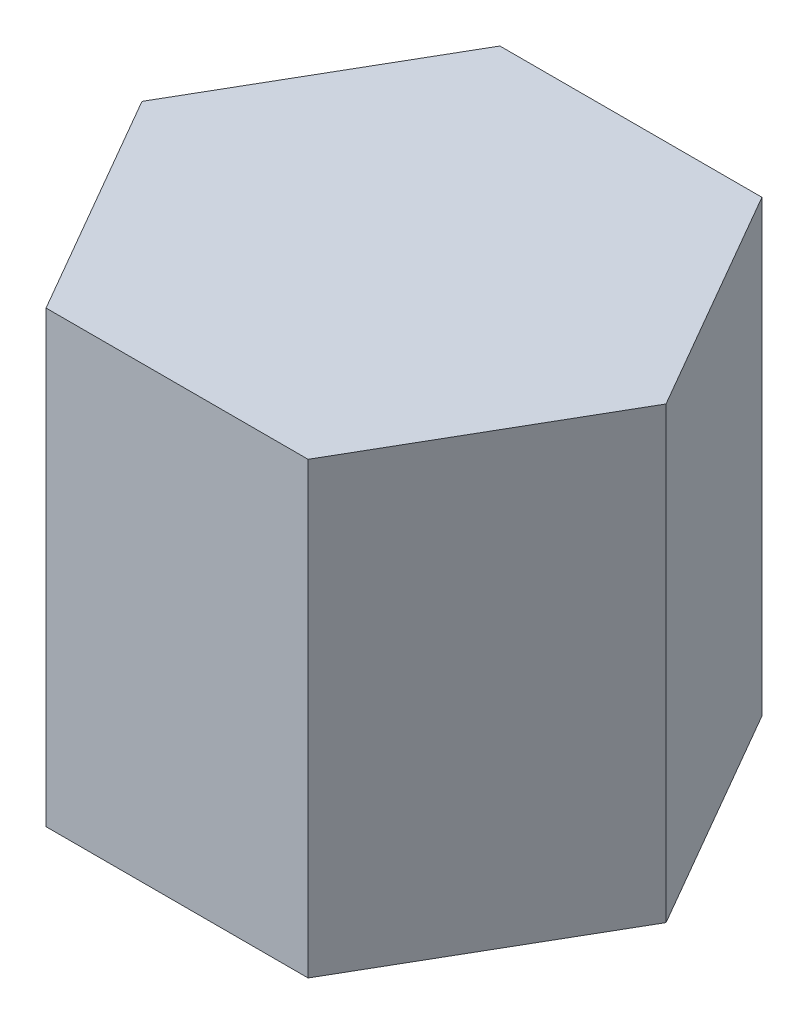
ISO-10303-21;
HEADER;
FILE_DESCRIPTION(('STEP AP214'),'2;1');
FILE_NAME('part.step','',(''),(''),'','','');
FILE_SCHEMA(('AUTOMOTIVE_DESIGN { 1 0 10303 214 1 1 1 1 }'));
ENDSEC;
DATA;
#1=APPLICATION_CONTEXT('core data for automotive mechanical design processes');
#2=APPLICATION_PROTOCOL_DEFINITION('international standard','automotive_design',2000,#1);
#3=PRODUCT_CONTEXT('',#1,'mechanical');
#4=PRODUCT('Part','Part','',(#3));
#5=PRODUCT_RELATED_PRODUCT_CATEGORY('part','',(#4));
#6=PRODUCT_DEFINITION_FORMATION('','',#4);
#7=PRODUCT_DEFINITION_CONTEXT('part definition',#1,'design');
#8=PRODUCT_DEFINITION('design','',#6,#7);
#9=PRODUCT_DEFINITION_SHAPE('','',#8);
#10=(LENGTH_UNIT() NAMED_UNIT(*) SI_UNIT(.MILLI.,.METRE.));
#11=(NAMED_UNIT(*) PLANE_ANGLE_UNIT() SI_UNIT($,.RADIAN.));
#12=(NAMED_UNIT(*) SI_UNIT($,.STERADIAN.) SOLID_ANGLE_UNIT());
#13=UNCERTAINTY_MEASURE_WITH_UNIT(LENGTH_MEASURE(1.E-05),#10,'distance_accuracy_value','');
#14=(GEOMETRIC_REPRESENTATION_CONTEXT(3) GLOBAL_UNCERTAINTY_ASSIGNED_CONTEXT((#13)) GLOBAL_UNIT_ASSIGNED_CONTEXT((#10,
#11,#12)) REPRESENTATION_CONTEXT('',''));
#15=CARTESIAN_POINT('',(0.,0.,0.));
#16=DIRECTION('',(0.,0.,1.));
#17=DIRECTION('',(1.,0.,0.));
#18=AXIS2_PLACEMENT_3D('',#15,#16,#17);
#19=CARTESIAN_POINT('',(44.4500000000008,152.4,76.9896583964359));
#20=DIRECTION('',(-0.866025403784442,0.,-0.499999999999995));
#21=DIRECTION('',(-0.499999999999995,0.,0.866025403784442));
#22=AXIS2_PLACEMENT_3D('',#19,#20,#21);
#23=PLANE('',#22);
#24=DIRECTION('',(0.499999999999995,0.,-0.866025403784441));
#25=VECTOR('',#24,1.);
#26=CARTESIAN_POINT('',(44.4500000000008,0.,76.9896583964359));
#27=LINE('',#26,#25);
#28=CARTESIAN_POINT('',(44.4500000000008,0.,76.9896583964359));
#29=VERTEX_POINT('',#28);
#30=CARTESIAN_POINT('',(88.8999999999998,0.,0.));
#31=VERTEX_POINT('',#30);
#32=EDGE_CURVE('E117',#29,#31,#27,.T.);
#33=ORIENTED_EDGE('',*,*,#32,.T.);
#34=DIRECTION('',(0.,-1.,0.));
#35=VECTOR('',#34,1.);
#36=CARTESIAN_POINT('',(88.8999999999998,152.4,0.));
#37=LINE('',#36,#35);
#38=CARTESIAN_POINT('',(88.8999999999998,152.4,0.));
#39=VERTEX_POINT('',#38);
#40=EDGE_CURVE('E11',#39,#31,#37,.T.);
#41=ORIENTED_EDGE('',*,*,#40,.F.);
#42=DIRECTION('',(0.499999999999995,0.,-0.866025403784441));
#43=VECTOR('',#42,1.);
#44=CARTESIAN_POINT('',(44.4500000000008,152.4,76.9896583964359));
#45=LINE('',#44,#43);
#46=CARTESIAN_POINT('',(44.4500000000008,152.4,76.9896583964359));
#47=VERTEX_POINT('',#46);
#48=EDGE_CURVE('E127',#47,#39,#45,.T.);
#49=ORIENTED_EDGE('',*,*,#48,.F.);
#50=DIRECTION('',(0.,-1.,0.));
#51=VECTOR('',#50,1.);
#52=CARTESIAN_POINT('',(44.4500000000008,152.4,76.9896583964359));
#53=LINE('',#52,#51);
#54=EDGE_CURVE('E113',#47,#29,#53,.T.);
#55=ORIENTED_EDGE('',*,*,#54,.T.);
#56=EDGE_LOOP('',(#33,#41,#49,#55));
#57=FACE_BOUND('',#56,.T.);
#58=ADVANCED_FACE('F33',(#57),#23,.F.);
#59=CARTESIAN_POINT('',(88.8999999999998,152.4,0.));
#60=DIRECTION('',(-0.866025403784438,0.,0.500000000000001));
#61=DIRECTION('',(0.500000000000001,0.,0.866025403784438));
#62=AXIS2_PLACEMENT_3D('',#59,#60,#61);
#63=PLANE('',#62);
#64=DIRECTION('',(-0.500000000000001,0.,-0.866025403784438));
#65=VECTOR('',#64,1.);
#66=CARTESIAN_POINT('',(88.8999999999998,0.,0.));
#67=LINE('',#66,#65);
#68=CARTESIAN_POINT('',(44.4499999999997,0.,-76.9896583964365));
#69=VERTEX_POINT('',#68);
#70=EDGE_CURVE('E120',#31,#69,#67,.T.);
#71=ORIENTED_EDGE('',*,*,#70,.T.);
#72=DIRECTION('',(0.,-1.,0.));
#73=VECTOR('',#72,1.);
#74=CARTESIAN_POINT('',(44.4499999999997,152.4,-76.9896583964365));
#75=LINE('',#74,#73);
#76=CARTESIAN_POINT('',(44.4499999999997,152.4,-76.9896583964365));
#77=VERTEX_POINT('',#76);
#78=EDGE_CURVE('E41',#77,#69,#75,.T.);
#79=ORIENTED_EDGE('',*,*,#78,.F.);
#80=DIRECTION('',(-0.500000000000001,0.,-0.866025403784438));
#81=VECTOR('',#80,1.);
#82=CARTESIAN_POINT('',(88.8999999999998,152.4,0.));
#83=LINE('',#82,#81);
#84=EDGE_CURVE('E86',#39,#77,#83,.T.);
#85=ORIENTED_EDGE('',*,*,#84,.F.);
#86=ORIENTED_EDGE('',*,*,#40,.T.);
#87=EDGE_LOOP('',(#71,#79,#85,#86));
#88=FACE_BOUND('',#87,.T.);
#89=ADVANCED_FACE('F151',(#88),#63,.F.);
#90=CARTESIAN_POINT('',(44.4499999999997,152.4,-76.9896583964365));
#91=DIRECTION('',(0.,0.,1.));
#92=DIRECTION('',(1.,0.,0.));
#93=AXIS2_PLACEMENT_3D('',#90,#91,#92);
#94=PLANE('',#93);
#95=DIRECTION('',(-1.,0.,0.));
#96=VECTOR('',#95,1.);
#97=CARTESIAN_POINT('',(44.4499999999997,0.,-76.9896583964365));
#98=LINE('',#97,#96);
#99=CARTESIAN_POINT('',(-44.4500000000003,0.,-76.9896583964362));
#100=VERTEX_POINT('',#99);
#101=EDGE_CURVE('E122',#69,#100,#98,.T.);
#102=ORIENTED_EDGE('',*,*,#101,.T.);
#103=DIRECTION('',(0.,-1.,0.));
#104=VECTOR('',#103,1.);
#105=CARTESIAN_POINT('',(-44.4500000000003,152.4,-76.9896583964362));
#106=LINE('',#105,#104);
#107=CARTESIAN_POINT('',(-44.4500000000003,152.4,-76.9896583964362));
#108=VERTEX_POINT('',#107);
#109=EDGE_CURVE('E108',#108,#100,#106,.T.);
#110=ORIENTED_EDGE('',*,*,#109,.F.);
#111=DIRECTION('',(-1.,0.,0.));
#112=VECTOR('',#111,1.);
#113=CARTESIAN_POINT('',(44.4499999999997,152.4,-76.9896583964365));
#114=LINE('',#113,#112);
#115=EDGE_CURVE('E99',#77,#108,#114,.T.);
#116=ORIENTED_EDGE('',*,*,#115,.F.);
#117=ORIENTED_EDGE('',*,*,#78,.T.);
#118=EDGE_LOOP('',(#102,#110,#116,#117));
#119=FACE_BOUND('',#118,.T.);
#120=ADVANCED_FACE('F133',(#119),#94,.F.);
#121=CARTESIAN_POINT('',(-44.4500000000003,152.4,-76.9896583964362));
#122=DIRECTION('',(0.866025403784442,0.,0.499999999999995));
#123=DIRECTION('',(0.499999999999995,0.,-0.866025403784442));
#124=AXIS2_PLACEMENT_3D('',#121,#122,#123);
#125=PLANE('',#124);
#126=DIRECTION('',(-0.499999999999995,0.,0.866025403784441));
#127=VECTOR('',#126,1.);
#128=CARTESIAN_POINT('',(-44.4500000000003,0.,-76.9896583964362));
#129=LINE('',#128,#127);
#130=CARTESIAN_POINT('',(-88.8999999999998,0.,6.20785382046308E-13));
#131=VERTEX_POINT('',#130);
#132=EDGE_CURVE('E107',#100,#131,#129,.T.);
#133=ORIENTED_EDGE('',*,*,#132,.T.);
#134=DIRECTION('',(0.,-1.,0.));
#135=VECTOR('',#134,1.);
#136=CARTESIAN_POINT('',(-88.8999999999998,152.4,6.20785382046308E-13));
#137=LINE('',#136,#135);
#138=CARTESIAN_POINT('',(-88.8999999999998,152.4,6.20785382046308E-13));
#139=VERTEX_POINT('',#138);
#140=EDGE_CURVE('E104',#139,#131,#137,.T.);
#141=ORIENTED_EDGE('',*,*,#140,.F.);
#142=DIRECTION('',(-0.499999999999995,0.,0.866025403784441));
#143=VECTOR('',#142,1.);
#144=CARTESIAN_POINT('',(-44.4500000000003,152.4,-76.9896583964362));
#145=LINE('',#144,#143);
#146=EDGE_CURVE('E93',#108,#139,#145,.T.);
#147=ORIENTED_EDGE('',*,*,#146,.F.);
#148=ORIENTED_EDGE('',*,*,#109,.T.);
#149=EDGE_LOOP('',(#133,#141,#147,#148));
#150=FACE_BOUND('',#149,.T.);
#151=ADVANCED_FACE('F105',(#150),#125,.F.);
#152=CARTESIAN_POINT('',(-88.8999999999998,152.4,6.20785382046308E-13));
#153=DIRECTION('',(0.866025403784434,0.,-0.500000000000007));
#154=DIRECTION('',(-0.500000000000007,0.,-0.866025403784435));
#155=AXIS2_PLACEMENT_3D('',#152,#153,#154);
#156=PLANE('',#155);
#157=DIRECTION('',(0.500000000000007,0.,0.866025403784435));
#158=VECTOR('',#157,1.);
#159=CARTESIAN_POINT('',(-88.8999999999998,0.,6.20785382046308E-13));
#160=LINE('',#159,#158);
#161=CARTESIAN_POINT('',(-44.4499999999992,0.,76.9896583964368));
#162=VERTEX_POINT('',#161);
#163=EDGE_CURVE('E72',#131,#162,#160,.T.);
#164=ORIENTED_EDGE('',*,*,#163,.T.);
#165=DIRECTION('',(0.,-1.,0.));
#166=VECTOR('',#165,1.);
#167=CARTESIAN_POINT('',(-44.4499999999992,152.4,76.9896583964368));
#168=LINE('',#167,#166);
#169=CARTESIAN_POINT('',(-44.4499999999992,152.4,76.9896583964368));
#170=VERTEX_POINT('',#169);
#171=EDGE_CURVE('E109',#170,#162,#168,.T.);
#172=ORIENTED_EDGE('',*,*,#171,.F.);
#173=DIRECTION('',(0.500000000000007,0.,0.866025403784435));
#174=VECTOR('',#173,1.);
#175=CARTESIAN_POINT('',(-88.8999999999998,152.4,6.20785382046308E-13));
#176=LINE('',#175,#174);
#177=EDGE_CURVE('E97',#139,#170,#176,.T.);
#178=ORIENTED_EDGE('',*,*,#177,.F.);
#179=ORIENTED_EDGE('',*,*,#140,.T.);
#180=EDGE_LOOP('',(#164,#172,#178,#179));
#181=FACE_BOUND('',#180,.T.);
#182=ADVANCED_FACE('F111',(#181),#156,.F.);
#183=CARTESIAN_POINT('',(-44.4499999999992,152.4,76.9896583964368));
#184=DIRECTION('',(0.,0.,-1.));
#185=DIRECTION('',(-1.,0.,0.));
#186=AXIS2_PLACEMENT_3D('',#183,#184,#185);
#187=PLANE('',#186);
#188=DIRECTION('',(1.,0.,0.));
#189=VECTOR('',#188,1.);
#190=CARTESIAN_POINT('',(-44.4499999999992,0.,76.9896583964368));
#191=LINE('',#190,#189);
#192=EDGE_CURVE('E78',#162,#29,#191,.T.);
#193=ORIENTED_EDGE('',*,*,#192,.T.);
#194=ORIENTED_EDGE('',*,*,#54,.F.);
#195=DIRECTION('',(1.,0.,0.));
#196=VECTOR('',#195,1.);
#197=CARTESIAN_POINT('',(-44.4499999999992,152.4,76.9896583964368));
#198=LINE('',#197,#196);
#199=EDGE_CURVE('E49',#170,#47,#198,.T.);
#200=ORIENTED_EDGE('',*,*,#199,.F.);
#201=ORIENTED_EDGE('',*,*,#171,.T.);
#202=EDGE_LOOP('',(#193,#194,#200,#201));
#203=FACE_BOUND('',#202,.T.);
#204=ADVANCED_FACE('F140',(#203),#187,.F.);
#205=CARTESIAN_POINT('',(0.,152.4,0.));
#206=DIRECTION('',(0.,1.,0.));
#207=DIRECTION('',(0.,0.,1.));
#208=AXIS2_PLACEMENT_3D('',#205,#206,#207);
#209=PLANE('',#208);
#210=ORIENTED_EDGE('',*,*,#48,.T.);
#211=ORIENTED_EDGE('',*,*,#84,.T.);
#212=ORIENTED_EDGE('',*,*,#115,.T.);
#213=ORIENTED_EDGE('',*,*,#146,.T.);
#214=ORIENTED_EDGE('',*,*,#177,.T.);
#215=ORIENTED_EDGE('',*,*,#199,.T.);
#216=EDGE_LOOP('',(#210,#211,#212,#213,#214,#215));
#217=FACE_BOUND('',#216,.T.);
#218=ADVANCED_FACE('F95',(#217),#209,.T.);
#219=CARTESIAN_POINT('',(0.,0.,0.));
#220=DIRECTION('',(0.,1.,0.));
#221=DIRECTION('',(0.,0.,1.));
#222=AXIS2_PLACEMENT_3D('',#219,#220,#221);
#223=PLANE('',#222);
#224=ORIENTED_EDGE('',*,*,#32,.F.);
#225=ORIENTED_EDGE('',*,*,#192,.F.);
#226=ORIENTED_EDGE('',*,*,#163,.F.);
#227=ORIENTED_EDGE('',*,*,#132,.F.);
#228=ORIENTED_EDGE('',*,*,#101,.F.);
#229=ORIENTED_EDGE('',*,*,#70,.F.);
#230=EDGE_LOOP('',(#224,#225,#226,#227,#228,#229));
#231=FACE_BOUND('',#230,.T.);
#232=ADVANCED_FACE('F136',(#231),#223,.F.);
#233=CLOSED_SHELL('',(#58,#89,#120,#151,#182,#204,#218,#232));
#234=MANIFOLD_SOLID_BREP('B2',#233);
#235=ADVANCED_BREP_SHAPE_REPRESENTATION('',(#18,#234),#14);
#236=SHAPE_DEFINITION_REPRESENTATION(#9,#235);
ENDSEC;
END-ISO-10303-21;
